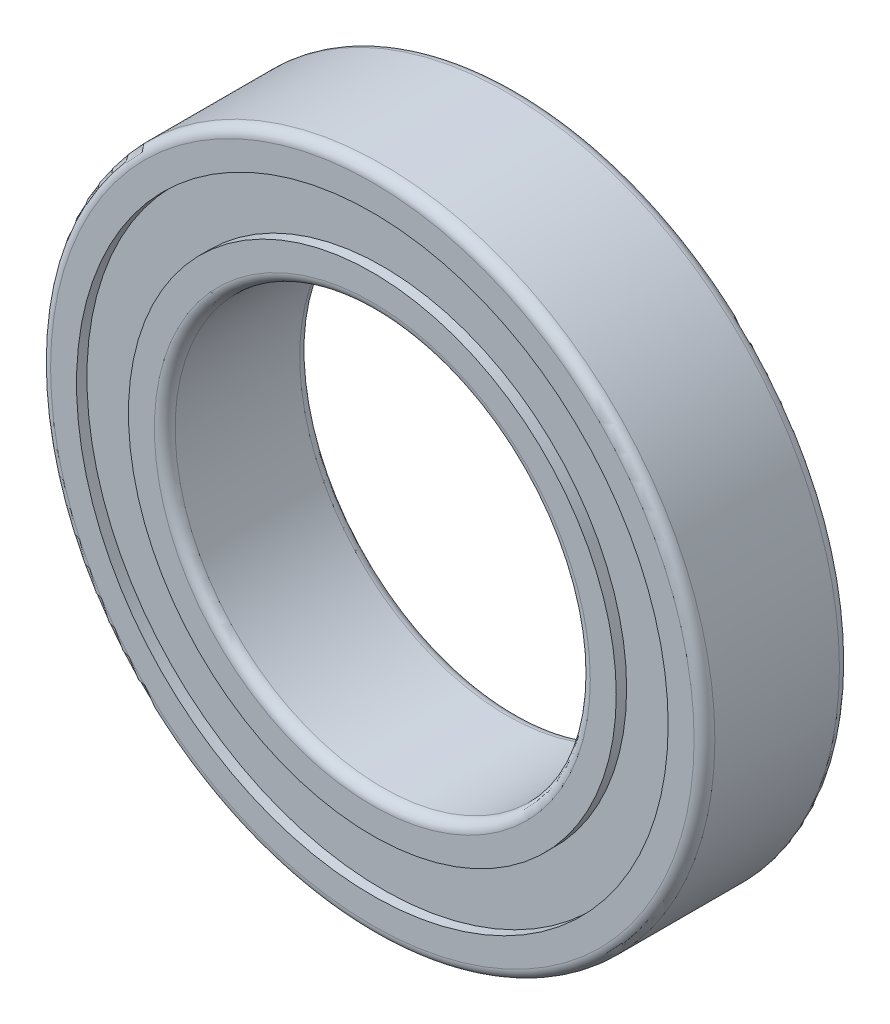
ISO-10303-21;
HEADER;
FILE_DESCRIPTION(('STEP AP214'),'2;1');
FILE_NAME('part.step','',(''),(''),'','','');
FILE_SCHEMA(('AUTOMOTIVE_DESIGN { 1 0 10303 214 1 1 1 1 }'));
ENDSEC;
DATA;
#1=APPLICATION_CONTEXT('core data for automotive mechanical design processes');
#2=APPLICATION_PROTOCOL_DEFINITION('international standard','automotive_design',2000,#1);
#3=PRODUCT_CONTEXT('',#1,'mechanical');
#4=PRODUCT('Part','Part','',(#3));
#5=PRODUCT_RELATED_PRODUCT_CATEGORY('part','',(#4));
#6=PRODUCT_DEFINITION_FORMATION('','',#4);
#7=PRODUCT_DEFINITION_CONTEXT('part definition',#1,'design');
#8=PRODUCT_DEFINITION('design','',#6,#7);
#9=PRODUCT_DEFINITION_SHAPE('','',#8);
#10=(LENGTH_UNIT() NAMED_UNIT(*) SI_UNIT(.MILLI.,.METRE.));
#11=(NAMED_UNIT(*) PLANE_ANGLE_UNIT() SI_UNIT($,.RADIAN.));
#12=(NAMED_UNIT(*) SI_UNIT($,.STERADIAN.) SOLID_ANGLE_UNIT());
#13=UNCERTAINTY_MEASURE_WITH_UNIT(LENGTH_MEASURE(1.E-05),#10,'distance_accuracy_value','');
#14=(GEOMETRIC_REPRESENTATION_CONTEXT(3) GLOBAL_UNCERTAINTY_ASSIGNED_CONTEXT((#13)) GLOBAL_UNIT_ASSIGNED_CONTEXT((#10,
#11,#12)) REPRESENTATION_CONTEXT('',''));
#15=CARTESIAN_POINT('',(0.,0.,0.));
#16=DIRECTION('',(0.,0.,1.));
#17=DIRECTION('',(1.,0.,0.));
#18=AXIS2_PLACEMENT_3D('',#15,#16,#17);
#19=CARTESIAN_POINT('',(80.0000000000053,28.257283518405,7.));
#20=DIRECTION('',(0.,0.,1.));
#21=DIRECTION('',(1.,0.,0.));
#22=AXIS2_PLACEMENT_3D('',#19,#20,#21);
#23=PLANE('',#22);
#24=CARTESIAN_POINT('',(80.0000000000053,28.257283518405,7.));
#25=DIRECTION('',(0.,0.,1.));
#26=DIRECTION('',(1.,0.,0.));
#27=AXIS2_PLACEMENT_3D('',#24,#25,#26);
#28=CIRCLE('',#27,10.5);
#29=CARTESIAN_POINT('',(90.5000000000053,28.257283518405,7.));
#30=VERTEX_POINT('',#29);
#31=EDGE_CURVE('E41',#30,#30,#28,.F.);
#32=ORIENTED_EDGE('',*,*,#31,.T.);
#33=EDGE_LOOP('',(#32));
#34=FACE_BOUND('',#33,.T.);
#35=CARTESIAN_POINT('',(80.0000000000053,28.257283518405,7.));
#36=DIRECTION('',(0.,0.,1.));
#37=DIRECTION('',(1.,0.,0.));
#38=AXIS2_PLACEMENT_3D('',#35,#36,#37);
#39=CIRCLE('',#38,11.75);
#40=CARTESIAN_POINT('',(91.7500000000053,28.257283518405,7.));
#41=VERTEX_POINT('',#40);
#42=EDGE_CURVE('E81',#41,#41,#39,.T.);
#43=ORIENTED_EDGE('',*,*,#42,.T.);
#44=EDGE_LOOP('',(#43));
#45=FACE_BOUND('',#44,.T.);
#46=ADVANCED_FACE('F30',(#34,#45),#23,.T.);
#47=CARTESIAN_POINT('',(80.0000000000053,28.257283518405,0.));
#48=DIRECTION('',(0.,0.,1.));
#49=DIRECTION('',(1.,0.,0.));
#50=AXIS2_PLACEMENT_3D('',#47,#48,#49);
#51=PLANE('',#50);
#52=CARTESIAN_POINT('',(80.0000000000053,28.257283518405,0.));
#53=DIRECTION('',(0.,0.,1.));
#54=DIRECTION('',(1.,0.,0.));
#55=AXIS2_PLACEMENT_3D('',#52,#53,#54);
#56=CIRCLE('',#55,10.5);
#57=CARTESIAN_POINT('',(90.5000000000053,28.257283518405,0.));
#58=VERTEX_POINT('',#57);
#59=EDGE_CURVE('E56',#58,#58,#56,.T.);
#60=ORIENTED_EDGE('',*,*,#59,.T.);
#61=EDGE_LOOP('',(#60));
#62=FACE_BOUND('',#61,.T.);
#63=CARTESIAN_POINT('',(80.0000000000053,28.257283518405,0.));
#64=DIRECTION('',(0.,0.,-1.));
#65=DIRECTION('',(-1.,0.,0.));
#66=AXIS2_PLACEMENT_3D('',#63,#64,#65);
#67=CIRCLE('',#66,11.75);
#68=CARTESIAN_POINT('',(68.2500000000053,28.257283518405,0.));
#69=VERTEX_POINT('',#68);
#70=EDGE_CURVE('E67',#69,#69,#67,.T.);
#71=ORIENTED_EDGE('',*,*,#70,.T.);
#72=EDGE_LOOP('',(#71));
#73=FACE_BOUND('',#72,.T.);
#74=ADVANCED_FACE('F107',(#62,#73),#51,.F.);
#75=CARTESIAN_POINT('',(80.0000000000053,28.257283518405,7.));
#76=DIRECTION('',(0.,0.,1.));
#77=DIRECTION('',(1.,0.,0.));
#78=AXIS2_PLACEMENT_3D('',#75,#76,#77);
#79=CIRCLE('',#78,14.25);
#80=CARTESIAN_POINT('',(94.2500000000053,28.257283518405,7.));
#81=VERTEX_POINT('',#80);
#82=EDGE_CURVE('E75',#81,#81,#79,.T.);
#83=ORIENTED_EDGE('',*,*,#82,.F.);
#84=EDGE_LOOP('',(#83));
#85=FACE_BOUND('',#84,.T.);
#86=CARTESIAN_POINT('',(80.0000000000053,28.257283518405,7.));
#87=DIRECTION('',(0.,0.,1.));
#88=DIRECTION('',(1.,0.,0.));
#89=AXIS2_PLACEMENT_3D('',#86,#87,#88);
#90=CIRCLE('',#89,15.5);
#91=CARTESIAN_POINT('',(95.5000000000053,28.257283518405,7.));
#92=VERTEX_POINT('',#91);
#93=EDGE_CURVE('E45',#92,#92,#90,.T.);
#94=ORIENTED_EDGE('',*,*,#93,.T.);
#95=EDGE_LOOP('',(#94));
#96=FACE_BOUND('',#95,.T.);
#97=ADVANCED_FACE('F103',(#85,#96),#23,.T.);
#98=CARTESIAN_POINT('',(80.0000000000053,28.257283518405,0.));
#99=DIRECTION('',(0.,0.,-1.));
#100=DIRECTION('',(-1.,0.,0.));
#101=AXIS2_PLACEMENT_3D('',#98,#99,#100);
#102=CIRCLE('',#101,14.25);
#103=CARTESIAN_POINT('',(65.7500000000053,28.257283518405,0.));
#104=VERTEX_POINT('',#103);
#105=EDGE_CURVE('E63',#104,#104,#102,.T.);
#106=ORIENTED_EDGE('',*,*,#105,.F.);
#107=EDGE_LOOP('',(#106));
#108=FACE_BOUND('',#107,.T.);
#109=CARTESIAN_POINT('',(80.0000000000053,28.257283518405,0.));
#110=DIRECTION('',(0.,0.,1.));
#111=DIRECTION('',(1.,0.,0.));
#112=AXIS2_PLACEMENT_3D('',#109,#110,#111);
#113=CIRCLE('',#112,15.5);
#114=CARTESIAN_POINT('',(95.5000000000053,28.257283518405,0.));
#115=VERTEX_POINT('',#114);
#116=EDGE_CURVE('E59',#115,#115,#113,.F.);
#117=ORIENTED_EDGE('',*,*,#116,.T.);
#118=EDGE_LOOP('',(#117));
#119=FACE_BOUND('',#118,.T.);
#120=ADVANCED_FACE('F106',(#108,#119),#51,.F.);
#121=CARTESIAN_POINT('',(80.0000000000053,28.257283518405,7.));
#122=DIRECTION('',(0.,0.,-1.));
#123=DIRECTION('',(-1.,0.,0.));
#124=AXIS2_PLACEMENT_3D('',#121,#122,#123);
#125=CYLINDRICAL_SURFACE('',#124,16.);
#126=CARTESIAN_POINT('',(80.0000000000053,28.257283518405,6.5));
#127=DIRECTION('',(0.,0.,1.));
#128=DIRECTION('',(1.,0.,0.));
#129=AXIS2_PLACEMENT_3D('',#126,#127,#128);
#130=CIRCLE('',#129,16.);
#131=CARTESIAN_POINT('',(96.0000000000053,28.257283518405,6.5));
#132=VERTEX_POINT('',#131);
#133=EDGE_CURVE('E10',#132,#132,#130,.F.);
#134=ORIENTED_EDGE('',*,*,#133,.T.);
#135=EDGE_LOOP('',(#134));
#136=FACE_BOUND('',#135,.T.);
#137=CARTESIAN_POINT('',(80.0000000000053,28.257283518405,0.5));
#138=DIRECTION('',(0.,0.,1.));
#139=DIRECTION('',(1.,0.,0.));
#140=AXIS2_PLACEMENT_3D('',#137,#138,#139);
#141=CIRCLE('',#140,16.);
#142=CARTESIAN_POINT('',(96.0000000000053,28.257283518405,0.5));
#143=VERTEX_POINT('',#142);
#144=EDGE_CURVE('E37',#143,#143,#141,.T.);
#145=ORIENTED_EDGE('',*,*,#144,.T.);
#146=EDGE_LOOP('',(#145));
#147=FACE_BOUND('',#146,.T.);
#148=ADVANCED_FACE('F137',(#136,#147),#125,.T.);
#149=CARTESIAN_POINT('',(80.0000000000053,28.257283518405,7.));
#150=DIRECTION('',(0.,0.,-1.));
#151=DIRECTION('',(-1.,0.,0.));
#152=AXIS2_PLACEMENT_3D('',#149,#150,#151);
#153=CYLINDRICAL_SURFACE('',#152,9.99999999999999);
#154=CARTESIAN_POINT('',(80.0000000000053,28.257283518405,0.5));
#155=DIRECTION('',(0.,0.,1.));
#156=DIRECTION('',(1.,0.,0.));
#157=AXIS2_PLACEMENT_3D('',#154,#155,#156);
#158=CIRCLE('',#157,9.99999999999999);
#159=CARTESIAN_POINT('',(90.0000000000053,28.257283518405,0.5));
#160=VERTEX_POINT('',#159);
#161=EDGE_CURVE('E50',#160,#160,#158,.F.);
#162=ORIENTED_EDGE('',*,*,#161,.T.);
#163=EDGE_LOOP('',(#162));
#164=FACE_BOUND('',#163,.T.);
#165=CARTESIAN_POINT('',(80.0000000000053,28.257283518405,6.5));
#166=DIRECTION('',(0.,0.,1.));
#167=DIRECTION('',(1.,0.,0.));
#168=AXIS2_PLACEMENT_3D('',#165,#166,#167);
#169=CIRCLE('',#168,9.99999999999999);
#170=CARTESIAN_POINT('',(90.0000000000053,28.257283518405,6.5));
#171=VERTEX_POINT('',#170);
#172=EDGE_CURVE('E53',#171,#171,#169,.T.);
#173=ORIENTED_EDGE('',*,*,#172,.T.);
#174=EDGE_LOOP('',(#173));
#175=FACE_BOUND('',#174,.T.);
#176=ADVANCED_FACE('F133',(#164,#175),#153,.F.);
#177=CARTESIAN_POINT('',(80.0000000000053,28.257283518405,0.5));
#178=DIRECTION('',(0.,0.,1.));
#179=DIRECTION('',(1.,0.,0.));
#180=AXIS2_PLACEMENT_3D('',#177,#178,#179);
#181=TOROIDAL_SURFACE('',#180,10.5,0.5);
#182=ORIENTED_EDGE('',*,*,#161,.F.);
#183=EDGE_LOOP('',(#182));
#184=FACE_BOUND('',#183,.T.);
#185=ORIENTED_EDGE('',*,*,#59,.F.);
#186=EDGE_LOOP('',(#185));
#187=FACE_BOUND('',#186,.T.);
#188=ADVANCED_FACE('F121',(#184,#187),#181,.T.);
#189=CARTESIAN_POINT('',(80.0000000000053,28.257283518405,6.5));
#190=DIRECTION('',(0.,0.,1.));
#191=DIRECTION('',(1.,0.,0.));
#192=AXIS2_PLACEMENT_3D('',#189,#190,#191);
#193=TOROIDAL_SURFACE('',#192,10.5,0.5);
#194=ORIENTED_EDGE('',*,*,#31,.F.);
#195=EDGE_LOOP('',(#194));
#196=FACE_BOUND('',#195,.T.);
#197=ORIENTED_EDGE('',*,*,#172,.F.);
#198=EDGE_LOOP('',(#197));
#199=FACE_BOUND('',#198,.T.);
#200=ADVANCED_FACE('F113',(#196,#199),#193,.T.);
#201=CARTESIAN_POINT('',(80.0000000000053,28.257283518405,6.5));
#202=DIRECTION('',(0.,0.,1.));
#203=DIRECTION('',(1.,0.,0.));
#204=AXIS2_PLACEMENT_3D('',#201,#202,#203);
#205=TOROIDAL_SURFACE('',#204,15.5,0.5);
#206=ORIENTED_EDGE('',*,*,#133,.F.);
#207=EDGE_LOOP('',(#206));
#208=FACE_BOUND('',#207,.T.);
#209=ORIENTED_EDGE('',*,*,#93,.F.);
#210=EDGE_LOOP('',(#209));
#211=FACE_BOUND('',#210,.T.);
#212=ADVANCED_FACE('F111',(#208,#211),#205,.T.);
#213=CARTESIAN_POINT('',(80.0000000000053,28.257283518405,0.5));
#214=DIRECTION('',(0.,0.,1.));
#215=DIRECTION('',(1.,0.,0.));
#216=AXIS2_PLACEMENT_3D('',#213,#214,#215);
#217=TOROIDAL_SURFACE('',#216,15.5,0.5);
#218=ORIENTED_EDGE('',*,*,#116,.F.);
#219=EDGE_LOOP('',(#218));
#220=FACE_BOUND('',#219,.T.);
#221=ORIENTED_EDGE('',*,*,#144,.F.);
#222=EDGE_LOOP('',(#221));
#223=FACE_BOUND('',#222,.T.);
#224=ADVANCED_FACE('F32',(#220,#223),#217,.T.);
#225=CARTESIAN_POINT('',(80.0000000000053,28.257283518405,0.5));
#226=DIRECTION('',(0.,0.,-1.));
#227=DIRECTION('',(-1.,0.,0.));
#228=AXIS2_PLACEMENT_3D('',#225,#226,#227);
#229=CYLINDRICAL_SURFACE('',#228,11.75);
#230=CARTESIAN_POINT('',(80.0000000000053,28.257283518405,0.5));
#231=DIRECTION('',(0.,0.,-1.));
#232=DIRECTION('',(-1.,0.,0.));
#233=AXIS2_PLACEMENT_3D('',#230,#231,#232);
#234=CIRCLE('',#233,11.75);
#235=CARTESIAN_POINT('',(68.2500000000053,28.257283518405,0.5));
#236=VERTEX_POINT('',#235);
#237=EDGE_CURVE('E66',#236,#236,#234,.T.);
#238=ORIENTED_EDGE('',*,*,#237,.T.);
#239=EDGE_LOOP('',(#238));
#240=FACE_BOUND('',#239,.T.);
#241=ORIENTED_EDGE('',*,*,#70,.F.);
#242=EDGE_LOOP('',(#241));
#243=FACE_BOUND('',#242,.T.);
#244=ADVANCED_FACE('F119',(#240,#243),#229,.T.);
#245=CARTESIAN_POINT('',(80.0000000000053,28.257283518405,0.5));
#246=DIRECTION('',(0.,0.,-1.));
#247=DIRECTION('',(-1.,0.,0.));
#248=AXIS2_PLACEMENT_3D('',#245,#246,#247);
#249=CYLINDRICAL_SURFACE('',#248,14.25);
#250=CARTESIAN_POINT('',(80.0000000000053,28.257283518405,0.5));
#251=DIRECTION('',(0.,0.,-1.));
#252=DIRECTION('',(-1.,0.,0.));
#253=AXIS2_PLACEMENT_3D('',#250,#251,#252);
#254=CIRCLE('',#253,14.25);
#255=CARTESIAN_POINT('',(65.7500000000053,28.257283518405,0.5));
#256=VERTEX_POINT('',#255);
#257=EDGE_CURVE('E62',#256,#256,#254,.T.);
#258=ORIENTED_EDGE('',*,*,#257,.F.);
#259=EDGE_LOOP('',(#258));
#260=FACE_BOUND('',#259,.T.);
#261=ORIENTED_EDGE('',*,*,#105,.T.);
#262=EDGE_LOOP('',(#261));
#263=FACE_BOUND('',#262,.T.);
#264=ADVANCED_FACE('F154',(#260,#263),#249,.F.);
#265=CARTESIAN_POINT('',(0.,0.,0.5));
#266=DIRECTION('',(0.,0.,-1.));
#267=DIRECTION('',(-1.,0.,0.));
#268=AXIS2_PLACEMENT_3D('',#265,#266,#267);
#269=PLANE('',#268);
#270=ORIENTED_EDGE('',*,*,#237,.F.);
#271=EDGE_LOOP('',(#270));
#272=FACE_BOUND('',#271,.T.);
#273=ORIENTED_EDGE('',*,*,#257,.T.);
#274=EDGE_LOOP('',(#273));
#275=FACE_BOUND('',#274,.T.);
#276=ADVANCED_FACE('F99',(#272,#275),#269,.T.);
#277=CARTESIAN_POINT('',(80.0000000000053,28.257283518405,6.5));
#278=DIRECTION('',(0.,0.,1.));
#279=DIRECTION('',(1.,0.,0.));
#280=AXIS2_PLACEMENT_3D('',#277,#278,#279);
#281=CYLINDRICAL_SURFACE('',#280,14.25);
#282=CARTESIAN_POINT('',(80.0000000000053,28.257283518405,6.5));
#283=DIRECTION('',(0.,0.,1.));
#284=DIRECTION('',(1.,0.,0.));
#285=AXIS2_PLACEMENT_3D('',#282,#283,#284);
#286=CIRCLE('',#285,14.25);
#287=CARTESIAN_POINT('',(94.2500000000053,28.257283518405,6.5));
#288=VERTEX_POINT('',#287);
#289=EDGE_CURVE('E70',#288,#288,#286,.T.);
#290=ORIENTED_EDGE('',*,*,#289,.F.);
#291=EDGE_LOOP('',(#290));
#292=FACE_BOUND('',#291,.T.);
#293=ORIENTED_EDGE('',*,*,#82,.T.);
#294=EDGE_LOOP('',(#293));
#295=FACE_BOUND('',#294,.T.);
#296=ADVANCED_FACE('F93',(#292,#295),#281,.F.);
#297=CARTESIAN_POINT('',(80.0000000000053,28.257283518405,6.5));
#298=DIRECTION('',(0.,0.,1.));
#299=DIRECTION('',(1.,0.,0.));
#300=AXIS2_PLACEMENT_3D('',#297,#298,#299);
#301=PLANE('',#300);
#302=CARTESIAN_POINT('',(80.0000000000053,28.257283518405,6.5));
#303=DIRECTION('',(0.,0.,1.));
#304=DIRECTION('',(1.,0.,0.));
#305=AXIS2_PLACEMENT_3D('',#302,#303,#304);
#306=CIRCLE('',#305,11.75);
#307=CARTESIAN_POINT('',(91.7500000000053,28.257283518405,6.5));
#308=VERTEX_POINT('',#307);
#309=EDGE_CURVE('E78',#308,#308,#306,.T.);
#310=ORIENTED_EDGE('',*,*,#309,.F.);
#311=EDGE_LOOP('',(#310));
#312=FACE_BOUND('',#311,.T.);
#313=ORIENTED_EDGE('',*,*,#289,.T.);
#314=EDGE_LOOP('',(#313));
#315=FACE_BOUND('',#314,.T.);
#316=ADVANCED_FACE('F90',(#312,#315),#301,.T.);
#317=CARTESIAN_POINT('',(80.0000000000053,28.257283518405,6.5));
#318=DIRECTION('',(0.,0.,1.));
#319=DIRECTION('',(1.,0.,0.));
#320=AXIS2_PLACEMENT_3D('',#317,#318,#319);
#321=CYLINDRICAL_SURFACE('',#320,11.75);
#322=ORIENTED_EDGE('',*,*,#309,.T.);
#323=EDGE_LOOP('',(#322));
#324=FACE_BOUND('',#323,.T.);
#325=ORIENTED_EDGE('',*,*,#42,.F.);
#326=EDGE_LOOP('',(#325));
#327=FACE_BOUND('',#326,.T.);
#328=ADVANCED_FACE('F87',(#324,#327),#321,.T.);
#329=CLOSED_SHELL('',(#46,#74,#97,#120,#148,#176,#188,#200,#212,#224,#244,#264,#276,#296,#316,#328));
#330=MANIFOLD_SOLID_BREP('B2',#329);
#331=ADVANCED_BREP_SHAPE_REPRESENTATION('',(#18,#330),#14);
#332=SHAPE_DEFINITION_REPRESENTATION(#9,#331);
ENDSEC;
END-ISO-10303-21;
